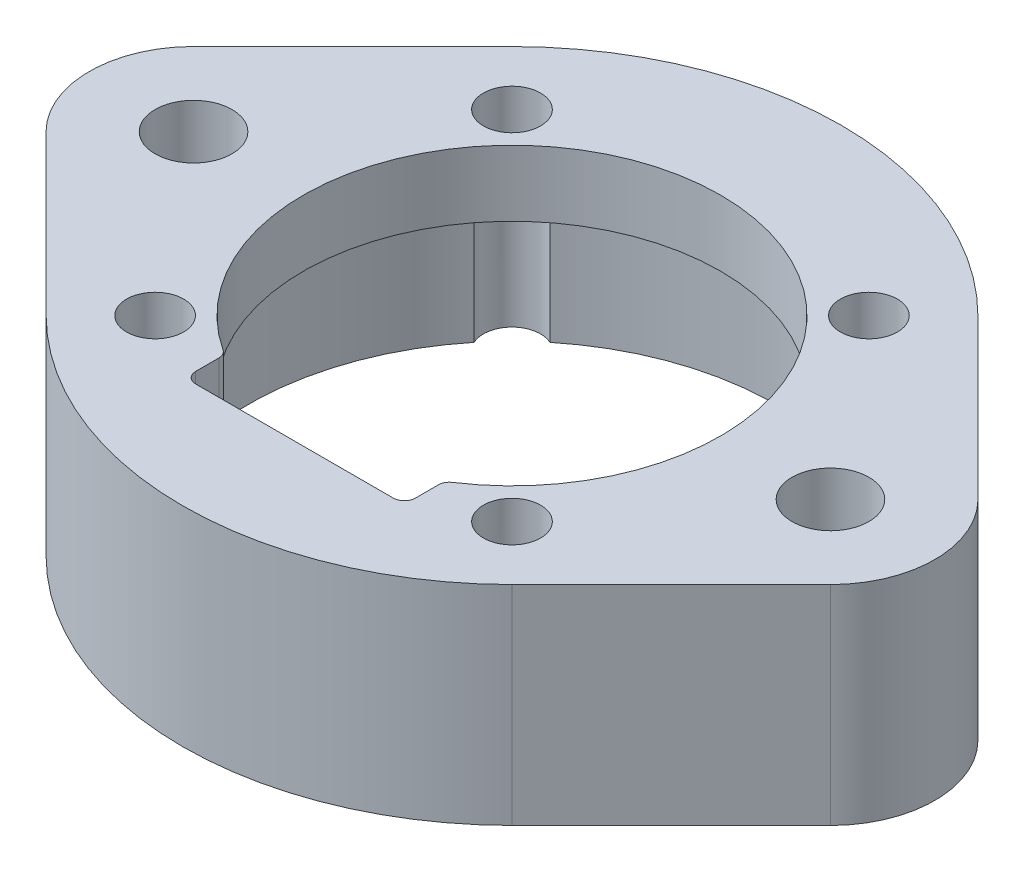
ISO-10303-21;
HEADER;
FILE_DESCRIPTION(('STEP AP214'),'2;1');
FILE_NAME('part.step','',(''),(''),'','','');
FILE_SCHEMA(('AUTOMOTIVE_DESIGN { 1 0 10303 214 1 1 1 1 }'));
ENDSEC;
DATA;
#1=APPLICATION_CONTEXT('core data for automotive mechanical design processes');
#2=APPLICATION_PROTOCOL_DEFINITION('international standard','automotive_design',2000,#1);
#3=PRODUCT_CONTEXT('',#1,'mechanical');
#4=PRODUCT('Part','Part','',(#3));
#5=PRODUCT_RELATED_PRODUCT_CATEGORY('part','',(#4));
#6=PRODUCT_DEFINITION_FORMATION('','',#4);
#7=PRODUCT_DEFINITION_CONTEXT('part definition',#1,'design');
#8=PRODUCT_DEFINITION('design','',#6,#7);
#9=PRODUCT_DEFINITION_SHAPE('','',#8);
#10=(LENGTH_UNIT() NAMED_UNIT(*) SI_UNIT(.MILLI.,.METRE.));
#11=(NAMED_UNIT(*) PLANE_ANGLE_UNIT() SI_UNIT($,.RADIAN.));
#12=(NAMED_UNIT(*) SI_UNIT($,.STERADIAN.) SOLID_ANGLE_UNIT());
#13=UNCERTAINTY_MEASURE_WITH_UNIT(LENGTH_MEASURE(1.E-05),#10,'distance_accuracy_value','');
#14=(GEOMETRIC_REPRESENTATION_CONTEXT(3) GLOBAL_UNCERTAINTY_ASSIGNED_CONTEXT((#13)) GLOBAL_UNIT_ASSIGNED_CONTEXT((#10,
#11,#12)) REPRESENTATION_CONTEXT('',''));
#15=CARTESIAN_POINT('',(0.,0.,0.));
#16=DIRECTION('',(0.,0.,1.));
#17=DIRECTION('',(1.,0.,0.));
#18=AXIS2_PLACEMENT_3D('',#15,#16,#17);
#19=CARTESIAN_POINT('',(0.,9.5,0.));
#20=DIRECTION('',(0.,-1.,0.));
#21=DIRECTION('',(0.,0.,-1.));
#22=AXIS2_PLACEMENT_3D('',#19,#20,#21);
#23=CYLINDRICAL_SURFACE('',#22,12.);
#24=DIRECTION('',(0.,1.,0.));
#25=VECTOR('',#24,1.);
#26=CARTESIAN_POINT('',(7.57815059832717,4.75,9.30438786321128));
#27=LINE('',#26,#25);
#28=CARTESIAN_POINT('',(7.57815059832717,0.,9.30438786321128));
#29=VERTEX_POINT('',#28);
#30=CARTESIAN_POINT('',(7.57815059832717,6.5,9.30438786321129));
#31=VERTEX_POINT('',#30);
#32=EDGE_CURVE('E283',#29,#31,#27,.T.);
#33=ORIENTED_EDGE('',*,*,#32,.F.);
#34=CARTESIAN_POINT('',(0.,0.,0.));
#35=DIRECTION('',(0.,1.,0.));
#36=DIRECTION('',(0.,0.,1.));
#37=AXIS2_PLACEMENT_3D('',#34,#35,#36);
#38=CIRCLE('',#37,12.);
#39=CARTESIAN_POINT('',(-7.57815059832717,0.,9.30438786321128));
#40=VERTEX_POINT('',#39);
#41=EDGE_CURVE('E241',#40,#29,#38,.T.);
#42=ORIENTED_EDGE('',*,*,#41,.F.);
#43=DIRECTION('',(0.,1.,0.));
#44=VECTOR('',#43,1.);
#45=CARTESIAN_POINT('',(-7.57815059832717,4.75,9.30438786321128));
#46=LINE('',#45,#44);
#47=CARTESIAN_POINT('',(-7.57815059832717,6.5,9.30438786321129));
#48=VERTEX_POINT('',#47);
#49=EDGE_CURVE('E294',#48,#40,#46,.F.);
#50=ORIENTED_EDGE('',*,*,#49,.F.);
#51=CARTESIAN_POINT('',(0.,6.5,0.));
#52=DIRECTION('',(0.,1.,0.));
#53=DIRECTION('',(0.,0.,1.));
#54=AXIS2_PLACEMENT_3D('',#51,#52,#53);
#55=CIRCLE('',#54,12.);
#56=EDGE_CURVE('E273',#48,#31,#55,.T.);
#57=ORIENTED_EDGE('',*,*,#56,.T.);
#58=EDGE_LOOP('',(#33,#42,#50,#57));
#59=FACE_BOUND('',#58,.T.);
#60=ADVANCED_FACE('F45',(#59),#23,.F.);
#61=DIRECTION('',(0.,1.,0.));
#62=VECTOR('',#61,1.);
#63=CARTESIAN_POINT('',(-9.30438786321128,4.75,7.57815059832718));
#64=LINE('',#63,#62);
#65=CARTESIAN_POINT('',(-9.30438786321128,0.,7.57815059832718));
#66=VERTEX_POINT('',#65);
#67=CARTESIAN_POINT('',(-9.30438786321129,6.5,7.57815059832717));
#68=VERTEX_POINT('',#67);
#69=EDGE_CURVE('E291',#66,#68,#64,.T.);
#70=ORIENTED_EDGE('',*,*,#69,.F.);
#71=CARTESIAN_POINT('',(-9.30438786321128,0.,-7.57815059832717));
#72=VERTEX_POINT('',#71);
#73=EDGE_CURVE('E247',#72,#66,#38,.T.);
#74=ORIENTED_EDGE('',*,*,#73,.F.);
#75=DIRECTION('',(0.,1.,0.));
#76=VECTOR('',#75,1.);
#77=CARTESIAN_POINT('',(-9.30438786321128,4.75,-7.57815059832717));
#78=LINE('',#77,#76);
#79=CARTESIAN_POINT('',(-9.30438786321129,6.5,-7.57815059832717));
#80=VERTEX_POINT('',#79);
#81=EDGE_CURVE('E230',#80,#72,#78,.F.);
#82=ORIENTED_EDGE('',*,*,#81,.F.);
#83=EDGE_CURVE('E277',#80,#68,#55,.T.);
#84=ORIENTED_EDGE('',*,*,#83,.T.);
#85=EDGE_LOOP('',(#70,#74,#82,#84));
#86=FACE_BOUND('',#85,.T.);
#87=ADVANCED_FACE('F575',(#86),#23,.F.);
#88=DIRECTION('',(0.,1.,0.));
#89=VECTOR('',#88,1.);
#90=CARTESIAN_POINT('',(-7.57815059832717,4.75,-9.30438786321128));
#91=LINE('',#90,#89);
#92=CARTESIAN_POINT('',(-7.57815059832717,0.,-9.30438786321128));
#93=VERTEX_POINT('',#92);
#94=CARTESIAN_POINT('',(-7.57815059832717,6.5,-9.30438786321129));
#95=VERTEX_POINT('',#94);
#96=EDGE_CURVE('E297',#93,#95,#91,.T.);
#97=ORIENTED_EDGE('',*,*,#96,.F.);
#98=CARTESIAN_POINT('',(7.57815059832717,0.,-9.30438786321128));
#99=VERTEX_POINT('',#98);
#100=EDGE_CURVE('E239',#99,#93,#38,.T.);
#101=ORIENTED_EDGE('',*,*,#100,.F.);
#102=DIRECTION('',(0.,1.,0.));
#103=VECTOR('',#102,1.);
#104=CARTESIAN_POINT('',(7.57815059832717,4.75,-9.30438786321128));
#105=LINE('',#104,#103);
#106=CARTESIAN_POINT('',(7.57815059832717,6.5,-9.30438786321129));
#107=VERTEX_POINT('',#106);
#108=EDGE_CURVE('E213',#107,#99,#105,.F.);
#109=ORIENTED_EDGE('',*,*,#108,.F.);
#110=EDGE_CURVE('E595',#107,#95,#55,.T.);
#111=ORIENTED_EDGE('',*,*,#110,.T.);
#112=EDGE_LOOP('',(#97,#101,#109,#111));
#113=FACE_BOUND('',#112,.T.);
#114=ADVANCED_FACE('F582',(#113),#23,.F.);
#115=DIRECTION('',(0.,1.,0.));
#116=VECTOR('',#115,1.);
#117=CARTESIAN_POINT('',(9.30438786321128,4.75,7.57815059832717));
#118=LINE('',#117,#116);
#119=CARTESIAN_POINT('',(9.30438786321129,6.5,7.57815059832717));
#120=VERTEX_POINT('',#119);
#121=CARTESIAN_POINT('',(9.30438786321128,0.,7.57815059832717));
#122=VERTEX_POINT('',#121);
#123=EDGE_CURVE('E288',#120,#122,#118,.F.);
#124=ORIENTED_EDGE('',*,*,#123,.F.);
#125=CARTESIAN_POINT('',(9.30438786321129,6.5,-7.57815059832717));
#126=VERTEX_POINT('',#125);
#127=EDGE_CURVE('E228',#120,#126,#55,.T.);
#128=ORIENTED_EDGE('',*,*,#127,.T.);
#129=DIRECTION('',(0.,1.,0.));
#130=VECTOR('',#129,1.);
#131=CARTESIAN_POINT('',(9.30438786321128,4.75,-7.57815059832717));
#132=LINE('',#131,#130);
#133=CARTESIAN_POINT('',(9.30438786321128,0.,-7.57815059832717));
#134=VERTEX_POINT('',#133);
#135=EDGE_CURVE('E210',#134,#126,#132,.T.);
#136=ORIENTED_EDGE('',*,*,#135,.F.);
#137=EDGE_CURVE('E226',#122,#134,#38,.T.);
#138=ORIENTED_EDGE('',*,*,#137,.F.);
#139=EDGE_LOOP('',(#124,#128,#136,#138));
#140=FACE_BOUND('',#139,.T.);
#141=ADVANCED_FACE('F225',(#140),#23,.F.);
#142=CARTESIAN_POINT('',(-14.5,9.5,0.));
#143=DIRECTION('',(0.,1.,0.));
#144=DIRECTION('',(0.,0.,1.));
#145=AXIS2_PLACEMENT_3D('',#142,#143,#144);
#146=PLANE('',#145);
#147=CARTESIAN_POINT('',(0.,9.5,0.));
#148=DIRECTION('',(0.,1.,0.));
#149=DIRECTION('',(0.,0.,1.));
#150=AXIS2_PLACEMENT_3D('',#147,#148,#149);
#151=CIRCLE('',#150,9.5);
#152=CARTESIAN_POINT('',(5.225,9.5,7.93406421703278));
#153=VERTEX_POINT('',#152);
#154=CARTESIAN_POINT('',(-5.225,9.5,7.93406421703278));
#155=VERTEX_POINT('',#154);
#156=EDGE_CURVE('E279',#153,#155,#151,.T.);
#157=ORIENTED_EDGE('',*,*,#156,.F.);
#158=CARTESIAN_POINT('',(5.5,9.5,8.35164654424503));
#159=DIRECTION('',(0.,1.,0.));
#160=DIRECTION('',(0.,0.,1.));
#161=AXIS2_PLACEMENT_3D('',#158,#159,#160);
#162=CIRCLE('',#161,0.5);
#163=CARTESIAN_POINT('',(5.,9.5,8.35164654424503));
#164=VERTEX_POINT('',#163);
#165=EDGE_CURVE('E410',#153,#164,#162,.T.);
#166=ORIENTED_EDGE('',*,*,#165,.T.);
#167=DIRECTION('',(0.,0.,-1.));
#168=VECTOR('',#167,1.);
#169=CARTESIAN_POINT('',(5.,9.5,9.9));
#170=LINE('',#169,#168);
#171=CARTESIAN_POINT('',(5.,9.5,9.4));
#172=VERTEX_POINT('',#171);
#173=EDGE_CURVE('E337',#172,#164,#170,.T.);
#174=ORIENTED_EDGE('',*,*,#173,.F.);
#175=CARTESIAN_POINT('',(4.5,9.5,9.4));
#176=DIRECTION('',(0.,1.,0.));
#177=DIRECTION('',(0.,0.,1.));
#178=AXIS2_PLACEMENT_3D('',#175,#176,#177);
#179=CIRCLE('',#178,0.5);
#180=CARTESIAN_POINT('',(4.5,9.5,9.9));
#181=VERTEX_POINT('',#180);
#182=EDGE_CURVE('E364',#172,#181,#179,.F.);
#183=ORIENTED_EDGE('',*,*,#182,.T.);
#184=DIRECTION('',(1.,0.,0.));
#185=VECTOR('',#184,1.);
#186=CARTESIAN_POINT('',(-5.,9.5,9.9));
#187=LINE('',#186,#185);
#188=CARTESIAN_POINT('',(-4.5,9.5,9.9));
#189=VERTEX_POINT('',#188);
#190=EDGE_CURVE('E329',#189,#181,#187,.T.);
#191=ORIENTED_EDGE('',*,*,#190,.F.);
#192=CARTESIAN_POINT('',(-4.5,9.5,9.4));
#193=DIRECTION('',(0.,1.,0.));
#194=DIRECTION('',(0.,0.,1.));
#195=AXIS2_PLACEMENT_3D('',#192,#193,#194);
#196=CIRCLE('',#195,0.5);
#197=CARTESIAN_POINT('',(-5.,9.5,9.4));
#198=VERTEX_POINT('',#197);
#199=EDGE_CURVE('E54',#189,#198,#196,.F.);
#200=ORIENTED_EDGE('',*,*,#199,.T.);
#201=DIRECTION('',(0.,0.,1.));
#202=VECTOR('',#201,1.);
#203=CARTESIAN_POINT('',(-5.,9.5,9.9));
#204=LINE('',#203,#202);
#205=CARTESIAN_POINT('',(-5.,9.5,8.35164654424503));
#206=VERTEX_POINT('',#205);
#207=EDGE_CURVE('E334',#206,#198,#204,.T.);
#208=ORIENTED_EDGE('',*,*,#207,.F.);
#209=CARTESIAN_POINT('',(-5.5,9.5,8.35164654424503));
#210=DIRECTION('',(0.,1.,0.));
#211=DIRECTION('',(0.,0.,1.));
#212=AXIS2_PLACEMENT_3D('',#209,#210,#211);
#213=CIRCLE('',#212,0.5);
#214=EDGE_CURVE('E358',#206,#155,#213,.T.);
#215=ORIENTED_EDGE('',*,*,#214,.T.);
#216=EDGE_LOOP('',(#157,#166,#174,#183,#191,#200,#208,#215));
#217=FACE_BOUND('',#216,.T.);
#218=CARTESIAN_POINT('',(8.125,9.5,8.125));
#219=DIRECTION('',(0.,1.,0.));
#220=DIRECTION('',(0.,0.,1.));
#221=AXIS2_PLACEMENT_3D('',#218,#219,#220);
#222=CIRCLE('',#221,1.3);
#223=CARTESIAN_POINT('',(8.125,9.5,9.425));
#224=VERTEX_POINT('',#223);
#225=EDGE_CURVE('E310',#224,#224,#222,.T.);
#226=ORIENTED_EDGE('',*,*,#225,.F.);
#227=EDGE_LOOP('',(#226));
#228=FACE_BOUND('',#227,.T.);
#229=CARTESIAN_POINT('',(-8.125,9.5,8.125));
#230=DIRECTION('',(0.,1.,0.));
#231=DIRECTION('',(0.,0.,1.));
#232=AXIS2_PLACEMENT_3D('',#229,#230,#231);
#233=CIRCLE('',#232,1.3);
#234=CARTESIAN_POINT('',(-8.125,9.5,9.425));
#235=VERTEX_POINT('',#234);
#236=EDGE_CURVE('E318',#235,#235,#233,.T.);
#237=ORIENTED_EDGE('',*,*,#236,.F.);
#238=EDGE_LOOP('',(#237));
#239=FACE_BOUND('',#238,.T.);
#240=CARTESIAN_POINT('',(-8.125,9.5,-8.125));
#241=DIRECTION('',(0.,1.,0.));
#242=DIRECTION('',(0.,0.,1.));
#243=AXIS2_PLACEMENT_3D('',#240,#241,#242);
#244=CIRCLE('',#243,1.3);
#245=CARTESIAN_POINT('',(-8.125,9.5,-6.825));
#246=VERTEX_POINT('',#245);
#247=EDGE_CURVE('E306',#246,#246,#244,.T.);
#248=ORIENTED_EDGE('',*,*,#247,.F.);
#249=EDGE_LOOP('',(#248));
#250=FACE_BOUND('',#249,.T.);
#251=CARTESIAN_POINT('',(8.125,9.5,-8.125));
#252=DIRECTION('',(0.,1.,0.));
#253=DIRECTION('',(0.,0.,1.));
#254=AXIS2_PLACEMENT_3D('',#251,#252,#253);
#255=CIRCLE('',#254,1.3);
#256=CARTESIAN_POINT('',(8.125,9.5,-6.825));
#257=VERTEX_POINT('',#256);
#258=EDGE_CURVE('E219',#257,#257,#255,.T.);
#259=ORIENTED_EDGE('',*,*,#258,.F.);
#260=EDGE_LOOP('',(#259));
#261=FACE_BOUND('',#260,.T.);
#262=CARTESIAN_POINT('',(-14.5,9.5,0.));
#263=DIRECTION('',(0.,1.,0.));
#264=DIRECTION('',(0.,0.,1.));
#265=AXIS2_PLACEMENT_3D('',#262,#263,#264);
#266=CIRCLE('',#265,1.75);
#267=CARTESIAN_POINT('',(-14.5,9.5,1.75));
#268=VERTEX_POINT('',#267);
#269=EDGE_CURVE('E251',#268,#268,#266,.T.);
#270=ORIENTED_EDGE('',*,*,#269,.F.);
#271=EDGE_LOOP('',(#270));
#272=FACE_BOUND('',#271,.T.);
#273=CARTESIAN_POINT('',(-14.5,9.5,0.));
#274=DIRECTION('',(0.,1.,0.));
#275=DIRECTION('',(0.,0.,1.));
#276=AXIS2_PLACEMENT_3D('',#273,#274,#275);
#277=CIRCLE('',#276,4.75);
#278=CARTESIAN_POINT('',(-17.8577586206897,9.5,-3.35975550378064));
#279=VERTEX_POINT('',#278);
#280=CARTESIAN_POINT('',(-17.8577586206897,9.5,3.35975550378064));
#281=VERTEX_POINT('',#280);
#282=EDGE_CURVE('E483',#279,#281,#277,.T.);
#283=ORIENTED_EDGE('',*,*,#282,.T.);
#284=DIRECTION('',(0.707316948164346,0.,0.706896551724138));
#285=VECTOR('',#284,1.);
#286=CARTESIAN_POINT('',(-17.8577586206897,9.5,3.35975550378064));
#287=LINE('',#286,#285);
#288=CARTESIAN_POINT('',(-10.6034482758621,9.5,10.6097542224652));
#289=VERTEX_POINT('',#288);
#290=EDGE_CURVE('E518',#281,#289,#287,.T.);
#291=ORIENTED_EDGE('',*,*,#290,.T.);
#292=CARTESIAN_POINT('',(0.,9.5,0.));
#293=DIRECTION('',(0.,1.,0.));
#294=DIRECTION('',(0.,0.,1.));
#295=AXIS2_PLACEMENT_3D('',#292,#293,#294);
#296=CIRCLE('',#295,15.);
#297=CARTESIAN_POINT('',(10.6034482758621,9.5,10.6097542224652));
#298=VERTEX_POINT('',#297);
#299=EDGE_CURVE('E515',#289,#298,#296,.T.);
#300=ORIENTED_EDGE('',*,*,#299,.T.);
#301=DIRECTION('',(0.707316948164346,0.,-0.706896551724138));
#302=VECTOR('',#301,1.);
#303=CARTESIAN_POINT('',(17.8577586206897,9.5,3.35975550378064));
#304=LINE('',#303,#302);
#305=CARTESIAN_POINT('',(17.8577586206897,9.5,3.35975550378064));
#306=VERTEX_POINT('',#305);
#307=EDGE_CURVE('E512',#298,#306,#304,.T.);
#308=ORIENTED_EDGE('',*,*,#307,.T.);
#309=CARTESIAN_POINT('',(14.5,9.5,0.));
#310=DIRECTION('',(0.,1.,0.));
#311=DIRECTION('',(0.,0.,-1.));
#312=AXIS2_PLACEMENT_3D('',#309,#310,#311);
#313=CIRCLE('',#312,4.75);
#314=CARTESIAN_POINT('',(17.8577586206897,9.5,-3.35975550378064));
#315=VERTEX_POINT('',#314);
#316=EDGE_CURVE('E509',#306,#315,#313,.T.);
#317=ORIENTED_EDGE('',*,*,#316,.T.);
#318=DIRECTION('',(-0.707316948164345,0.,-0.706896551724138));
#319=VECTOR('',#318,1.);
#320=CARTESIAN_POINT('',(17.8577586206897,9.5,-3.35975550378064));
#321=LINE('',#320,#319);
#322=CARTESIAN_POINT('',(10.6034482758621,9.5,-10.6097542224652));
#323=VERTEX_POINT('',#322);
#324=EDGE_CURVE('E506',#315,#323,#321,.T.);
#325=ORIENTED_EDGE('',*,*,#324,.T.);
#326=CARTESIAN_POINT('',(0.,9.5,0.));
#327=DIRECTION('',(0.,1.,0.));
#328=DIRECTION('',(0.,0.,1.));
#329=AXIS2_PLACEMENT_3D('',#326,#327,#328);
#330=CIRCLE('',#329,15.);
#331=CARTESIAN_POINT('',(-10.6034482758621,9.5,-10.6097542224652));
#332=VERTEX_POINT('',#331);
#333=EDGE_CURVE('E503',#323,#332,#330,.T.);
#334=ORIENTED_EDGE('',*,*,#333,.T.);
#335=DIRECTION('',(-0.707316948164345,0.,0.706896551724138));
#336=VECTOR('',#335,1.);
#337=CARTESIAN_POINT('',(-17.8577586206897,9.5,-3.35975550378064));
#338=LINE('',#337,#336);
#339=EDGE_CURVE('E479',#332,#279,#338,.T.);
#340=ORIENTED_EDGE('',*,*,#339,.T.);
#341=EDGE_LOOP('',(#283,#291,#300,#308,#317,#325,#334,#340));
#342=FACE_BOUND('',#341,.T.);
#343=CARTESIAN_POINT('',(14.5,9.5,0.));
#344=DIRECTION('',(0.,1.,0.));
#345=DIRECTION('',(0.,0.,-1.));
#346=AXIS2_PLACEMENT_3D('',#343,#344,#345);
#347=CIRCLE('',#346,1.75);
#348=CARTESIAN_POINT('',(14.5,9.5,-1.75));
#349=VERTEX_POINT('',#348);
#350=EDGE_CURVE('E264',#349,#349,#347,.T.);
#351=ORIENTED_EDGE('',*,*,#350,.F.);
#352=EDGE_LOOP('',(#351));
#353=FACE_BOUND('',#352,.T.);
#354=ADVANCED_FACE('F378',(#217,#228,#239,#250,#261,#272,#342,#353),#146,.T.);
#355=CARTESIAN_POINT('',(-14.5,0.,0.));
#356=DIRECTION('',(0.,1.,0.));
#357=DIRECTION('',(0.,0.,1.));
#358=AXIS2_PLACEMENT_3D('',#355,#356,#357);
#359=PLANE('',#358);
#360=CARTESIAN_POINT('',(-14.5,0.,0.));
#361=DIRECTION('',(0.,1.,0.));
#362=DIRECTION('',(0.,0.,1.));
#363=AXIS2_PLACEMENT_3D('',#360,#361,#362);
#364=CIRCLE('',#363,4.75);
#365=CARTESIAN_POINT('',(-17.8577586206897,0.,-3.35975550378064));
#366=VERTEX_POINT('',#365);
#367=CARTESIAN_POINT('',(-17.8577586206897,0.,3.35975550378064));
#368=VERTEX_POINT('',#367);
#369=EDGE_CURVE('E238',#366,#368,#364,.T.);
#370=ORIENTED_EDGE('',*,*,#369,.F.);
#371=DIRECTION('',(-0.707316948164345,0.,0.706896551724138));
#372=VECTOR('',#371,1.);
#373=CARTESIAN_POINT('',(-17.8577586206897,0.,-3.35975550378064));
#374=LINE('',#373,#372);
#375=CARTESIAN_POINT('',(-10.6034482758621,0.,-10.6097542224652));
#376=VERTEX_POINT('',#375);
#377=EDGE_CURVE('E480',#376,#366,#374,.T.);
#378=ORIENTED_EDGE('',*,*,#377,.F.);
#379=CARTESIAN_POINT('',(0.,0.,0.));
#380=DIRECTION('',(0.,1.,0.));
#381=DIRECTION('',(0.,0.,1.));
#382=AXIS2_PLACEMENT_3D('',#379,#380,#381);
#383=CIRCLE('',#382,15.);
#384=CARTESIAN_POINT('',(10.6034482758621,0.,-10.6097542224652));
#385=VERTEX_POINT('',#384);
#386=EDGE_CURVE('E484',#385,#376,#383,.T.);
#387=ORIENTED_EDGE('',*,*,#386,.F.);
#388=DIRECTION('',(-0.707316948164345,0.,-0.706896551724138));
#389=VECTOR('',#388,1.);
#390=CARTESIAN_POINT('',(17.8577586206897,0.,-3.35975550378064));
#391=LINE('',#390,#389);
#392=CARTESIAN_POINT('',(17.8577586206897,0.,-3.35975550378064));
#393=VERTEX_POINT('',#392);
#394=EDGE_CURVE('E487',#393,#385,#391,.T.);
#395=ORIENTED_EDGE('',*,*,#394,.F.);
#396=CARTESIAN_POINT('',(14.5,0.,0.));
#397=DIRECTION('',(0.,1.,0.));
#398=DIRECTION('',(0.,0.,-1.));
#399=AXIS2_PLACEMENT_3D('',#396,#397,#398);
#400=CIRCLE('',#399,4.75);
#401=CARTESIAN_POINT('',(17.8577586206897,0.,3.35975550378064));
#402=VERTEX_POINT('',#401);
#403=EDGE_CURVE('E490',#402,#393,#400,.T.);
#404=ORIENTED_EDGE('',*,*,#403,.F.);
#405=DIRECTION('',(0.707316948164346,0.,-0.706896551724138));
#406=VECTOR('',#405,1.);
#407=CARTESIAN_POINT('',(17.8577586206897,0.,3.35975550378064));
#408=LINE('',#407,#406);
#409=CARTESIAN_POINT('',(10.6034482758621,0.,10.6097542224652));
#410=VERTEX_POINT('',#409);
#411=EDGE_CURVE('E493',#410,#402,#408,.T.);
#412=ORIENTED_EDGE('',*,*,#411,.F.);
#413=CARTESIAN_POINT('',(0.,0.,0.));
#414=DIRECTION('',(0.,1.,0.));
#415=DIRECTION('',(0.,0.,1.));
#416=AXIS2_PLACEMENT_3D('',#413,#414,#415);
#417=CIRCLE('',#416,15.);
#418=CARTESIAN_POINT('',(-10.6034482758621,0.,10.6097542224652));
#419=VERTEX_POINT('',#418);
#420=EDGE_CURVE('E496',#419,#410,#417,.T.);
#421=ORIENTED_EDGE('',*,*,#420,.F.);
#422=DIRECTION('',(0.707316948164346,0.,0.706896551724138));
#423=VECTOR('',#422,1.);
#424=CARTESIAN_POINT('',(-17.8577586206897,0.,3.35975550378064));
#425=LINE('',#424,#423);
#426=EDGE_CURVE('E245',#368,#419,#425,.T.);
#427=ORIENTED_EDGE('',*,*,#426,.F.);
#428=EDGE_LOOP('',(#370,#378,#387,#395,#404,#412,#421,#427));
#429=FACE_BOUND('',#428,.T.);
#430=ORIENTED_EDGE('',*,*,#41,.T.);
#431=CARTESIAN_POINT('',(8.125,0.,8.125));
#432=DIRECTION('',(0.,1.,0.));
#433=DIRECTION('',(0.,0.,1.));
#434=AXIS2_PLACEMENT_3D('',#431,#432,#433);
#435=CIRCLE('',#434,1.3);
#436=EDGE_CURVE('E236',#29,#122,#435,.T.);
#437=ORIENTED_EDGE('',*,*,#436,.T.);
#438=ORIENTED_EDGE('',*,*,#137,.T.);
#439=CARTESIAN_POINT('',(8.125,0.,-8.125));
#440=DIRECTION('',(0.,1.,0.));
#441=DIRECTION('',(0.,0.,1.));
#442=AXIS2_PLACEMENT_3D('',#439,#440,#441);
#443=CIRCLE('',#442,1.3);
#444=EDGE_CURVE('E206',#134,#99,#443,.T.);
#445=ORIENTED_EDGE('',*,*,#444,.T.);
#446=ORIENTED_EDGE('',*,*,#100,.T.);
#447=CARTESIAN_POINT('',(-8.125,0.,-8.125));
#448=DIRECTION('',(0.,1.,0.));
#449=DIRECTION('',(0.,0.,1.));
#450=AXIS2_PLACEMENT_3D('',#447,#448,#449);
#451=CIRCLE('',#450,1.3);
#452=EDGE_CURVE('E322',#93,#72,#451,.T.);
#453=ORIENTED_EDGE('',*,*,#452,.T.);
#454=ORIENTED_EDGE('',*,*,#73,.T.);
#455=CARTESIAN_POINT('',(-8.125,0.,8.125));
#456=DIRECTION('',(0.,1.,0.));
#457=DIRECTION('',(0.,0.,1.));
#458=AXIS2_PLACEMENT_3D('',#455,#456,#457);
#459=CIRCLE('',#458,1.3);
#460=EDGE_CURVE('E315',#66,#40,#459,.T.);
#461=ORIENTED_EDGE('',*,*,#460,.T.);
#462=EDGE_LOOP('',(#430,#437,#438,#445,#446,#453,#454,#461));
#463=FACE_BOUND('',#462,.T.);
#464=CARTESIAN_POINT('',(-14.5,0.,0.));
#465=DIRECTION('',(0.,1.,0.));
#466=DIRECTION('',(0.,0.,1.));
#467=AXIS2_PLACEMENT_3D('',#464,#465,#466);
#468=CIRCLE('',#467,1.75);
#469=CARTESIAN_POINT('',(-14.5,0.,1.75));
#470=VERTEX_POINT('',#469);
#471=EDGE_CURVE('E258',#470,#470,#468,.T.);
#472=ORIENTED_EDGE('',*,*,#471,.T.);
#473=EDGE_LOOP('',(#472));
#474=FACE_BOUND('',#473,.T.);
#475=CARTESIAN_POINT('',(14.5,0.,0.));
#476=DIRECTION('',(0.,1.,0.));
#477=DIRECTION('',(0.,0.,-1.));
#478=AXIS2_PLACEMENT_3D('',#475,#476,#477);
#479=CIRCLE('',#478,1.75);
#480=CARTESIAN_POINT('',(14.5,0.,-1.75));
#481=VERTEX_POINT('',#480);
#482=EDGE_CURVE('E266',#481,#481,#479,.T.);
#483=ORIENTED_EDGE('',*,*,#482,.T.);
#484=EDGE_LOOP('',(#483));
#485=FACE_BOUND('',#484,.T.);
#486=ADVANCED_FACE('F234',(#429,#463,#474,#485),#359,.F.);
#487=CARTESIAN_POINT('',(-14.5,9.5,0.));
#488=DIRECTION('',(0.,-1.,0.));
#489=DIRECTION('',(0.,0.,-1.));
#490=AXIS2_PLACEMENT_3D('',#487,#488,#489);
#491=CYLINDRICAL_SURFACE('',#490,4.75);
#492=ORIENTED_EDGE('',*,*,#369,.T.);
#493=DIRECTION('',(0.,-1.,0.));
#494=VECTOR('',#493,1.);
#495=CARTESIAN_POINT('',(-17.8577586206897,9.5,3.35975550378064));
#496=LINE('',#495,#494);
#497=EDGE_CURVE('E447',#281,#368,#496,.T.);
#498=ORIENTED_EDGE('',*,*,#497,.F.);
#499=ORIENTED_EDGE('',*,*,#282,.F.);
#500=DIRECTION('',(0.,-1.,0.));
#501=VECTOR('',#500,1.);
#502=CARTESIAN_POINT('',(-17.8577586206897,9.5,-3.35975550378064));
#503=LINE('',#502,#501);
#504=EDGE_CURVE('E475',#279,#366,#503,.T.);
#505=ORIENTED_EDGE('',*,*,#504,.T.);
#506=EDGE_LOOP('',(#492,#498,#499,#505));
#507=FACE_BOUND('',#506,.T.);
#508=ADVANCED_FACE('F530',(#507),#491,.T.);
#509=CARTESIAN_POINT('',(-17.8577586206897,9.5,3.35975550378064));
#510=DIRECTION('',(0.706896551724138,0.,-0.707316948164346));
#511=DIRECTION('',(-0.707316948164346,0.,-0.706896551724138));
#512=AXIS2_PLACEMENT_3D('',#509,#510,#511);
#513=PLANE('',#512);
#514=ORIENTED_EDGE('',*,*,#426,.T.);
#515=DIRECTION('',(0.,-1.,0.));
#516=VECTOR('',#515,1.);
#517=CARTESIAN_POINT('',(-10.6034482758621,9.5,10.6097542224652));
#518=LINE('',#517,#516);
#519=EDGE_CURVE('E451',#289,#419,#518,.T.);
#520=ORIENTED_EDGE('',*,*,#519,.F.);
#521=ORIENTED_EDGE('',*,*,#290,.F.);
#522=ORIENTED_EDGE('',*,*,#497,.T.);
#523=EDGE_LOOP('',(#514,#520,#521,#522));
#524=FACE_BOUND('',#523,.T.);
#525=ADVANCED_FACE('F533',(#524),#513,.F.);
#526=CARTESIAN_POINT('',(0.,9.5,0.));
#527=DIRECTION('',(0.,-1.,0.));
#528=DIRECTION('',(0.,0.,-1.));
#529=AXIS2_PLACEMENT_3D('',#526,#527,#528);
#530=CYLINDRICAL_SURFACE('',#529,15.);
#531=ORIENTED_EDGE('',*,*,#420,.T.);
#532=DIRECTION('',(0.,-1.,0.));
#533=VECTOR('',#532,1.);
#534=CARTESIAN_POINT('',(10.6034482758621,9.5,10.6097542224652));
#535=LINE('',#534,#533);
#536=EDGE_CURVE('E455',#298,#410,#535,.T.);
#537=ORIENTED_EDGE('',*,*,#536,.F.);
#538=ORIENTED_EDGE('',*,*,#299,.F.);
#539=ORIENTED_EDGE('',*,*,#519,.T.);
#540=EDGE_LOOP('',(#531,#537,#538,#539));
#541=FACE_BOUND('',#540,.T.);
#542=ADVANCED_FACE('F538',(#541),#530,.T.);
#543=CARTESIAN_POINT('',(17.8577586206897,9.5,3.35975550378064));
#544=DIRECTION('',(-0.706896551724138,0.,-0.707316948164346));
#545=DIRECTION('',(-0.707316948164346,0.,0.706896551724138));
#546=AXIS2_PLACEMENT_3D('',#543,#544,#545);
#547=PLANE('',#546);
#548=ORIENTED_EDGE('',*,*,#411,.T.);
#549=DIRECTION('',(0.,-1.,0.));
#550=VECTOR('',#549,1.);
#551=CARTESIAN_POINT('',(17.8577586206897,9.5,3.35975550378064));
#552=LINE('',#551,#550);
#553=EDGE_CURVE('E459',#306,#402,#552,.T.);
#554=ORIENTED_EDGE('',*,*,#553,.F.);
#555=ORIENTED_EDGE('',*,*,#307,.F.);
#556=ORIENTED_EDGE('',*,*,#536,.T.);
#557=EDGE_LOOP('',(#548,#554,#555,#556));
#558=FACE_BOUND('',#557,.T.);
#559=ADVANCED_FACE('F544',(#558),#547,.F.);
#560=CARTESIAN_POINT('',(14.5,9.5,0.));
#561=DIRECTION('',(0.,-1.,0.));
#562=DIRECTION('',(0.,0.,-1.));
#563=AXIS2_PLACEMENT_3D('',#560,#561,#562);
#564=CYLINDRICAL_SURFACE('',#563,4.75);
#565=ORIENTED_EDGE('',*,*,#403,.T.);
#566=DIRECTION('',(0.,-1.,0.));
#567=VECTOR('',#566,1.);
#568=CARTESIAN_POINT('',(17.8577586206897,9.5,-3.35975550378064));
#569=LINE('',#568,#567);
#570=EDGE_CURVE('E463',#315,#393,#569,.T.);
#571=ORIENTED_EDGE('',*,*,#570,.F.);
#572=ORIENTED_EDGE('',*,*,#316,.F.);
#573=ORIENTED_EDGE('',*,*,#553,.T.);
#574=EDGE_LOOP('',(#565,#571,#572,#573));
#575=FACE_BOUND('',#574,.T.);
#576=ADVANCED_FACE('F548',(#575),#564,.T.);
#577=CARTESIAN_POINT('',(17.8577586206897,9.5,-3.35975550378064));
#578=DIRECTION('',(-0.706896551724138,0.,0.707316948164345));
#579=DIRECTION('',(0.707316948164345,0.,0.706896551724138));
#580=AXIS2_PLACEMENT_3D('',#577,#578,#579);
#581=PLANE('',#580);
#582=ORIENTED_EDGE('',*,*,#394,.T.);
#583=DIRECTION('',(0.,-1.,0.));
#584=VECTOR('',#583,1.);
#585=CARTESIAN_POINT('',(10.6034482758621,9.5,-10.6097542224652));
#586=LINE('',#585,#584);
#587=EDGE_CURVE('E467',#323,#385,#586,.T.);
#588=ORIENTED_EDGE('',*,*,#587,.F.);
#589=ORIENTED_EDGE('',*,*,#324,.F.);
#590=ORIENTED_EDGE('',*,*,#570,.T.);
#591=EDGE_LOOP('',(#582,#588,#589,#590));
#592=FACE_BOUND('',#591,.T.);
#593=ADVANCED_FACE('F553',(#592),#581,.F.);
#594=CARTESIAN_POINT('',(0.,9.5,0.));
#595=DIRECTION('',(0.,-1.,0.));
#596=DIRECTION('',(0.,0.,-1.));
#597=AXIS2_PLACEMENT_3D('',#594,#595,#596);
#598=CYLINDRICAL_SURFACE('',#597,15.);
#599=ORIENTED_EDGE('',*,*,#386,.T.);
#600=DIRECTION('',(0.,-1.,0.));
#601=VECTOR('',#600,1.);
#602=CARTESIAN_POINT('',(-10.6034482758621,9.5,-10.6097542224652));
#603=LINE('',#602,#601);
#604=EDGE_CURVE('E471',#332,#376,#603,.T.);
#605=ORIENTED_EDGE('',*,*,#604,.F.);
#606=ORIENTED_EDGE('',*,*,#333,.F.);
#607=ORIENTED_EDGE('',*,*,#587,.T.);
#608=EDGE_LOOP('',(#599,#605,#606,#607));
#609=FACE_BOUND('',#608,.T.);
#610=ADVANCED_FACE('F557',(#609),#598,.T.);
#611=CARTESIAN_POINT('',(-17.8577586206897,9.5,-3.35975550378064));
#612=DIRECTION('',(0.706896551724138,0.,0.707316948164345));
#613=DIRECTION('',(0.707316948164345,0.,-0.706896551724138));
#614=AXIS2_PLACEMENT_3D('',#611,#612,#613);
#615=PLANE('',#614);
#616=ORIENTED_EDGE('',*,*,#377,.T.);
#617=ORIENTED_EDGE('',*,*,#504,.F.);
#618=ORIENTED_EDGE('',*,*,#339,.F.);
#619=ORIENTED_EDGE('',*,*,#604,.T.);
#620=EDGE_LOOP('',(#616,#617,#618,#619));
#621=FACE_BOUND('',#620,.T.);
#622=ADVANCED_FACE('F561',(#621),#615,.F.);
#623=CARTESIAN_POINT('',(-14.5,9.5,0.));
#624=DIRECTION('',(0.,-1.,0.));
#625=DIRECTION('',(0.,0.,-1.));
#626=AXIS2_PLACEMENT_3D('',#623,#624,#625);
#627=CYLINDRICAL_SURFACE('',#626,1.75);
#628=ORIENTED_EDGE('',*,*,#269,.T.);
#629=EDGE_LOOP('',(#628));
#630=FACE_BOUND('',#629,.T.);
#631=ORIENTED_EDGE('',*,*,#471,.F.);
#632=EDGE_LOOP('',(#631));
#633=FACE_BOUND('',#632,.T.);
#634=ADVANCED_FACE('F633',(#630,#633),#627,.F.);
#635=CARTESIAN_POINT('',(14.5,9.5,0.));
#636=DIRECTION('',(0.,-1.,0.));
#637=DIRECTION('',(0.,0.,-1.));
#638=AXIS2_PLACEMENT_3D('',#635,#636,#637);
#639=CYLINDRICAL_SURFACE('',#638,1.75);
#640=ORIENTED_EDGE('',*,*,#350,.T.);
#641=EDGE_LOOP('',(#640));
#642=FACE_BOUND('',#641,.T.);
#643=ORIENTED_EDGE('',*,*,#482,.F.);
#644=EDGE_LOOP('',(#643));
#645=FACE_BOUND('',#644,.T.);
#646=ADVANCED_FACE('F632',(#642,#645),#639,.F.);
#647=CARTESIAN_POINT('',(0.,6.5,0.));
#648=DIRECTION('',(0.,1.,0.));
#649=DIRECTION('',(0.,0.,1.));
#650=AXIS2_PLACEMENT_3D('',#647,#648,#649);
#651=PLANE('',#650);
#652=DIRECTION('',(0.,0.,1.));
#653=VECTOR('',#652,1.);
#654=CARTESIAN_POINT('',(5.,6.5,9.9));
#655=LINE('',#654,#653);
#656=CARTESIAN_POINT('',(5.,6.5,8.35164654424503));
#657=VERTEX_POINT('',#656);
#658=CARTESIAN_POINT('',(5.,6.5,9.4));
#659=VERTEX_POINT('',#658);
#660=EDGE_CURVE('E311',#657,#659,#655,.T.);
#661=ORIENTED_EDGE('',*,*,#660,.F.);
#662=CARTESIAN_POINT('',(5.5,6.5,8.35164654424503));
#663=DIRECTION('',(0.,1.,0.));
#664=DIRECTION('',(0.,0.,1.));
#665=AXIS2_PLACEMENT_3D('',#662,#663,#664);
#666=CIRCLE('',#665,0.5);
#667=CARTESIAN_POINT('',(5.225,6.5,7.93406421703278));
#668=VERTEX_POINT('',#667);
#669=EDGE_CURVE('E408',#657,#668,#666,.F.);
#670=ORIENTED_EDGE('',*,*,#669,.T.);
#671=CARTESIAN_POINT('',(0.,6.5,0.));
#672=DIRECTION('',(0.,1.,0.));
#673=DIRECTION('',(0.,0.,1.));
#674=AXIS2_PLACEMENT_3D('',#671,#672,#673);
#675=CIRCLE('',#674,9.5);
#676=CARTESIAN_POINT('',(-5.225,6.5,7.93406421703278));
#677=VERTEX_POINT('',#676);
#678=EDGE_CURVE('E278',#668,#677,#675,.T.);
#679=ORIENTED_EDGE('',*,*,#678,.T.);
#680=CARTESIAN_POINT('',(-5.5,6.5,8.35164654424503));
#681=DIRECTION('',(0.,1.,0.));
#682=DIRECTION('',(0.,0.,1.));
#683=AXIS2_PLACEMENT_3D('',#680,#681,#682);
#684=CIRCLE('',#683,0.5);
#685=CARTESIAN_POINT('',(-5.,6.5,8.35164654424503));
#686=VERTEX_POINT('',#685);
#687=EDGE_CURVE('E61',#677,#686,#684,.F.);
#688=ORIENTED_EDGE('',*,*,#687,.T.);
#689=DIRECTION('',(0.,0.,-1.));
#690=VECTOR('',#689,1.);
#691=CARTESIAN_POINT('',(-5.,6.5,9.9));
#692=LINE('',#691,#690);
#693=CARTESIAN_POINT('',(-5.,6.5,9.4));
#694=VERTEX_POINT('',#693);
#695=EDGE_CURVE('E333',#694,#686,#692,.T.);
#696=ORIENTED_EDGE('',*,*,#695,.F.);
#697=CARTESIAN_POINT('',(-4.5,6.5,9.4));
#698=DIRECTION('',(0.,1.,0.));
#699=DIRECTION('',(0.,0.,1.));
#700=AXIS2_PLACEMENT_3D('',#697,#698,#699);
#701=CIRCLE('',#700,0.5);
#702=CARTESIAN_POINT('',(-4.5,6.5,9.9));
#703=VERTEX_POINT('',#702);
#704=EDGE_CURVE('E11',#694,#703,#701,.T.);
#705=ORIENTED_EDGE('',*,*,#704,.T.);
#706=DIRECTION('',(-1.,0.,0.));
#707=VECTOR('',#706,1.);
#708=CARTESIAN_POINT('',(-5.,6.5,9.9));
#709=LINE('',#708,#707);
#710=CARTESIAN_POINT('',(4.5,6.5,9.9));
#711=VERTEX_POINT('',#710);
#712=EDGE_CURVE('E344',#711,#703,#709,.T.);
#713=ORIENTED_EDGE('',*,*,#712,.F.);
#714=CARTESIAN_POINT('',(4.5,6.5,9.4));
#715=DIRECTION('',(0.,1.,0.));
#716=DIRECTION('',(0.,0.,1.));
#717=AXIS2_PLACEMENT_3D('',#714,#715,#716);
#718=CIRCLE('',#717,0.5);
#719=EDGE_CURVE('E372',#711,#659,#718,.T.);
#720=ORIENTED_EDGE('',*,*,#719,.T.);
#721=EDGE_LOOP('',(#661,#670,#679,#688,#696,#705,#713,#720));
#722=FACE_BOUND('',#721,.T.);
#723=ORIENTED_EDGE('',*,*,#127,.F.);
#724=CARTESIAN_POINT('',(8.125,6.5,8.125));
#725=DIRECTION('',(0.,1.,0.));
#726=DIRECTION('',(0.,0.,1.));
#727=AXIS2_PLACEMENT_3D('',#724,#725,#726);
#728=CIRCLE('',#727,1.3);
#729=EDGE_CURVE('E429',#120,#31,#728,.T.);
#730=ORIENTED_EDGE('',*,*,#729,.T.);
#731=ORIENTED_EDGE('',*,*,#56,.F.);
#732=CARTESIAN_POINT('',(-8.125,6.5,8.125));
#733=DIRECTION('',(0.,1.,0.));
#734=DIRECTION('',(0.,0.,1.));
#735=AXIS2_PLACEMENT_3D('',#732,#733,#734);
#736=CIRCLE('',#735,1.3);
#737=EDGE_CURVE('E436',#48,#68,#736,.T.);
#738=ORIENTED_EDGE('',*,*,#737,.T.);
#739=ORIENTED_EDGE('',*,*,#83,.F.);
#740=CARTESIAN_POINT('',(-8.125,6.5,-8.125));
#741=DIRECTION('',(0.,1.,0.));
#742=DIRECTION('',(0.,0.,1.));
#743=AXIS2_PLACEMENT_3D('',#740,#741,#742);
#744=CIRCLE('',#743,1.3);
#745=EDGE_CURVE('E440',#80,#95,#744,.T.);
#746=ORIENTED_EDGE('',*,*,#745,.T.);
#747=ORIENTED_EDGE('',*,*,#110,.F.);
#748=CARTESIAN_POINT('',(8.125,6.5,-8.125));
#749=DIRECTION('',(0.,1.,0.));
#750=DIRECTION('',(0.,0.,1.));
#751=AXIS2_PLACEMENT_3D('',#748,#749,#750);
#752=CIRCLE('',#751,1.3);
#753=EDGE_CURVE('E444',#107,#126,#752,.T.);
#754=ORIENTED_EDGE('',*,*,#753,.T.);
#755=EDGE_LOOP('',(#723,#730,#731,#738,#739,#746,#747,#754));
#756=FACE_BOUND('',#755,.T.);
#757=ADVANCED_FACE('F386',(#722,#756),#651,.F.);
#758=CARTESIAN_POINT('',(0.,6.5,0.));
#759=DIRECTION('',(0.,1.,0.));
#760=DIRECTION('',(0.,0.,1.));
#761=AXIS2_PLACEMENT_3D('',#758,#759,#760);
#762=CYLINDRICAL_SURFACE('',#761,9.5);
#763=ORIENTED_EDGE('',*,*,#678,.F.);
#764=DIRECTION('',(0.,1.,0.));
#765=VECTOR('',#764,1.);
#766=CARTESIAN_POINT('',(5.225,6.5,7.93406421703278));
#767=LINE('',#766,#765);
#768=EDGE_CURVE('E421',#668,#153,#767,.T.);
#769=ORIENTED_EDGE('',*,*,#768,.T.);
#770=ORIENTED_EDGE('',*,*,#156,.T.);
#771=DIRECTION('',(0.,1.,0.));
#772=VECTOR('',#771,1.);
#773=CARTESIAN_POINT('',(-5.225,6.5,7.93406421703278));
#774=LINE('',#773,#772);
#775=EDGE_CURVE('E422',#155,#677,#774,.F.);
#776=ORIENTED_EDGE('',*,*,#775,.T.);
#777=EDGE_LOOP('',(#763,#769,#770,#776));
#778=FACE_BOUND('',#777,.T.);
#779=ADVANCED_FACE('F420',(#778),#762,.F.);
#780=CARTESIAN_POINT('',(8.125,0.,-8.125));
#781=DIRECTION('',(0.,1.,0.));
#782=DIRECTION('',(0.,0.,1.));
#783=AXIS2_PLACEMENT_3D('',#780,#781,#782);
#784=CYLINDRICAL_SURFACE('',#783,1.3);
#785=ORIENTED_EDGE('',*,*,#135,.T.);
#786=ORIENTED_EDGE('',*,*,#753,.F.);
#787=ORIENTED_EDGE('',*,*,#108,.T.);
#788=ORIENTED_EDGE('',*,*,#444,.F.);
#789=EDGE_LOOP('',(#785,#786,#787,#788));
#790=FACE_BOUND('',#789,.T.);
#791=ORIENTED_EDGE('',*,*,#258,.T.);
#792=EDGE_LOOP('',(#791));
#793=FACE_BOUND('',#792,.T.);
#794=ADVANCED_FACE('F208',(#790,#793),#784,.F.);
#795=CARTESIAN_POINT('',(-8.125,0.,-8.125));
#796=DIRECTION('',(0.,1.,0.));
#797=DIRECTION('',(0.,0.,1.));
#798=AXIS2_PLACEMENT_3D('',#795,#796,#797);
#799=CYLINDRICAL_SURFACE('',#798,1.3);
#800=ORIENTED_EDGE('',*,*,#96,.T.);
#801=ORIENTED_EDGE('',*,*,#745,.F.);
#802=ORIENTED_EDGE('',*,*,#81,.T.);
#803=ORIENTED_EDGE('',*,*,#452,.F.);
#804=EDGE_LOOP('',(#800,#801,#802,#803));
#805=FACE_BOUND('',#804,.T.);
#806=ORIENTED_EDGE('',*,*,#247,.T.);
#807=EDGE_LOOP('',(#806));
#808=FACE_BOUND('',#807,.T.);
#809=ADVANCED_FACE('F613',(#805,#808),#799,.F.);
#810=CARTESIAN_POINT('',(-8.125,0.,8.125));
#811=DIRECTION('',(0.,1.,0.));
#812=DIRECTION('',(0.,0.,1.));
#813=AXIS2_PLACEMENT_3D('',#810,#811,#812);
#814=CYLINDRICAL_SURFACE('',#813,1.3);
#815=ORIENTED_EDGE('',*,*,#69,.T.);
#816=ORIENTED_EDGE('',*,*,#737,.F.);
#817=ORIENTED_EDGE('',*,*,#49,.T.);
#818=ORIENTED_EDGE('',*,*,#460,.F.);
#819=EDGE_LOOP('',(#815,#816,#817,#818));
#820=FACE_BOUND('',#819,.T.);
#821=ORIENTED_EDGE('',*,*,#236,.T.);
#822=EDGE_LOOP('',(#821));
#823=FACE_BOUND('',#822,.T.);
#824=ADVANCED_FACE('F603',(#820,#823),#814,.F.);
#825=CARTESIAN_POINT('',(8.125,0.,8.125));
#826=DIRECTION('',(0.,1.,0.));
#827=DIRECTION('',(0.,0.,1.));
#828=AXIS2_PLACEMENT_3D('',#825,#826,#827);
#829=CYLINDRICAL_SURFACE('',#828,1.3);
#830=ORIENTED_EDGE('',*,*,#32,.T.);
#831=ORIENTED_EDGE('',*,*,#729,.F.);
#832=ORIENTED_EDGE('',*,*,#123,.T.);
#833=ORIENTED_EDGE('',*,*,#436,.F.);
#834=EDGE_LOOP('',(#830,#831,#832,#833));
#835=FACE_BOUND('',#834,.T.);
#836=ORIENTED_EDGE('',*,*,#225,.T.);
#837=EDGE_LOOP('',(#836));
#838=FACE_BOUND('',#837,.T.);
#839=ADVANCED_FACE('F608',(#835,#838),#829,.F.);
#840=CARTESIAN_POINT('',(5.,-4.68033988749895,9.9));
#841=DIRECTION('',(1.,0.,0.));
#842=DIRECTION('',(0.,0.,-1.));
#843=AXIS2_PLACEMENT_3D('',#840,#841,#842);
#844=PLANE('',#843);
#845=ORIENTED_EDGE('',*,*,#173,.T.);
#846=DIRECTION('',(0.,1.,0.));
#847=VECTOR('',#846,1.);
#848=CARTESIAN_POINT('',(5.,-4.68033988749895,8.35164654424503));
#849=LINE('',#848,#847);
#850=EDGE_CURVE('E402',#164,#657,#849,.F.);
#851=ORIENTED_EDGE('',*,*,#850,.T.);
#852=ORIENTED_EDGE('',*,*,#660,.T.);
#853=DIRECTION('',(0.,1.,0.));
#854=VECTOR('',#853,1.);
#855=CARTESIAN_POINT('',(5.,9.5,9.4));
#856=LINE('',#855,#854);
#857=EDGE_CURVE('E396',#659,#172,#856,.T.);
#858=ORIENTED_EDGE('',*,*,#857,.T.);
#859=EDGE_LOOP('',(#845,#851,#852,#858));
#860=FACE_BOUND('',#859,.T.);
#861=ADVANCED_FACE('F399',(#860),#844,.F.);
#862=CARTESIAN_POINT('',(-5.,-4.68033988749895,9.9));
#863=DIRECTION('',(-1.,0.,0.));
#864=DIRECTION('',(0.,0.,1.));
#865=AXIS2_PLACEMENT_3D('',#862,#863,#864);
#866=PLANE('',#865);
#867=ORIENTED_EDGE('',*,*,#207,.T.);
#868=DIRECTION('',(0.,1.,0.));
#869=VECTOR('',#868,1.);
#870=CARTESIAN_POINT('',(-5.,6.5,9.4));
#871=LINE('',#870,#869);
#872=EDGE_CURVE('E68',#198,#694,#871,.F.);
#873=ORIENTED_EDGE('',*,*,#872,.T.);
#874=ORIENTED_EDGE('',*,*,#695,.T.);
#875=DIRECTION('',(0.,1.,0.));
#876=VECTOR('',#875,1.);
#877=CARTESIAN_POINT('',(-5.,-4.68033988749895,8.35164654424503));
#878=LINE('',#877,#876);
#879=EDGE_CURVE('E351',#686,#206,#878,.T.);
#880=ORIENTED_EDGE('',*,*,#879,.T.);
#881=EDGE_LOOP('',(#867,#873,#874,#880));
#882=FACE_BOUND('',#881,.T.);
#883=ADVANCED_FACE('F350',(#882),#866,.F.);
#884=CARTESIAN_POINT('',(-5.,-4.68033988749895,9.9));
#885=DIRECTION('',(0.,0.,1.));
#886=DIRECTION('',(1.,0.,0.));
#887=AXIS2_PLACEMENT_3D('',#884,#885,#886);
#888=PLANE('',#887);
#889=ORIENTED_EDGE('',*,*,#190,.T.);
#890=DIRECTION('',(0.,1.,0.));
#891=VECTOR('',#890,1.);
#892=CARTESIAN_POINT('',(4.5,6.5,9.9));
#893=LINE('',#892,#891);
#894=EDGE_CURVE('E360',#181,#711,#893,.F.);
#895=ORIENTED_EDGE('',*,*,#894,.T.);
#896=ORIENTED_EDGE('',*,*,#712,.T.);
#897=DIRECTION('',(0.,1.,0.));
#898=VECTOR('',#897,1.);
#899=CARTESIAN_POINT('',(-4.5,9.5,9.9));
#900=LINE('',#899,#898);
#901=EDGE_CURVE('E366',#703,#189,#900,.T.);
#902=ORIENTED_EDGE('',*,*,#901,.T.);
#903=EDGE_LOOP('',(#889,#895,#896,#902));
#904=FACE_BOUND('',#903,.T.);
#905=ADVANCED_FACE('F390',(#904),#888,.F.);
#906=CARTESIAN_POINT('',(5.5,6.5,8.35164654424503));
#907=DIRECTION('',(0.,1.,0.));
#908=DIRECTION('',(0.,0.,1.));
#909=AXIS2_PLACEMENT_3D('',#906,#907,#908);
#910=CYLINDRICAL_SURFACE('',#909,0.5);
#911=ORIENTED_EDGE('',*,*,#669,.F.);
#912=ORIENTED_EDGE('',*,*,#850,.F.);
#913=ORIENTED_EDGE('',*,*,#165,.F.);
#914=ORIENTED_EDGE('',*,*,#768,.F.);
#915=EDGE_LOOP('',(#911,#912,#913,#914));
#916=FACE_BOUND('',#915,.T.);
#917=ADVANCED_FACE('F423',(#916),#910,.T.);
#918=CARTESIAN_POINT('',(4.5,-4.68033988749895,9.4));
#919=DIRECTION('',(0.,-1.,0.));
#920=DIRECTION('',(0.,0.,-1.));
#921=AXIS2_PLACEMENT_3D('',#918,#919,#920);
#922=CYLINDRICAL_SURFACE('',#921,0.5);
#923=ORIENTED_EDGE('',*,*,#719,.F.);
#924=ORIENTED_EDGE('',*,*,#894,.F.);
#925=ORIENTED_EDGE('',*,*,#182,.F.);
#926=ORIENTED_EDGE('',*,*,#857,.F.);
#927=EDGE_LOOP('',(#923,#924,#925,#926));
#928=FACE_BOUND('',#927,.T.);
#929=ADVANCED_FACE('F393',(#928),#922,.F.);
#930=CARTESIAN_POINT('',(-4.5,-4.68033988749895,9.4));
#931=DIRECTION('',(0.,-1.,0.));
#932=DIRECTION('',(0.,0.,-1.));
#933=AXIS2_PLACEMENT_3D('',#930,#931,#932);
#934=CYLINDRICAL_SURFACE('',#933,0.5);
#935=ORIENTED_EDGE('',*,*,#704,.F.);
#936=ORIENTED_EDGE('',*,*,#872,.F.);
#937=ORIENTED_EDGE('',*,*,#199,.F.);
#938=ORIENTED_EDGE('',*,*,#901,.F.);
#939=EDGE_LOOP('',(#935,#936,#937,#938));
#940=FACE_BOUND('',#939,.T.);
#941=ADVANCED_FACE('F383',(#940),#934,.F.);
#942=CARTESIAN_POINT('',(-5.5,6.5,8.35164654424503));
#943=DIRECTION('',(0.,1.,0.));
#944=DIRECTION('',(0.,0.,1.));
#945=AXIS2_PLACEMENT_3D('',#942,#943,#944);
#946=CYLINDRICAL_SURFACE('',#945,0.5);
#947=ORIENTED_EDGE('',*,*,#214,.F.);
#948=ORIENTED_EDGE('',*,*,#879,.F.);
#949=ORIENTED_EDGE('',*,*,#687,.F.);
#950=ORIENTED_EDGE('',*,*,#775,.F.);
#951=EDGE_LOOP('',(#947,#948,#949,#950));
#952=FACE_BOUND('',#951,.T.);
#953=ADVANCED_FACE('F47',(#952),#946,.T.);
#954=CLOSED_SHELL('',(#60,#87,#114,#141,#354,#486,#508,#525,#542,#559,#576,#593,#610,#622,#634,
#646,#757,#779,#794,#809,#824,#839,#861,#883,#905,#917,#929,#941,#953));
#955=MANIFOLD_SOLID_BREP('B2',#954);
#956=ADVANCED_BREP_SHAPE_REPRESENTATION('',(#18,#955),#14);
#957=SHAPE_DEFINITION_REPRESENTATION(#9,#956);
ENDSEC;
END-ISO-10303-21;
